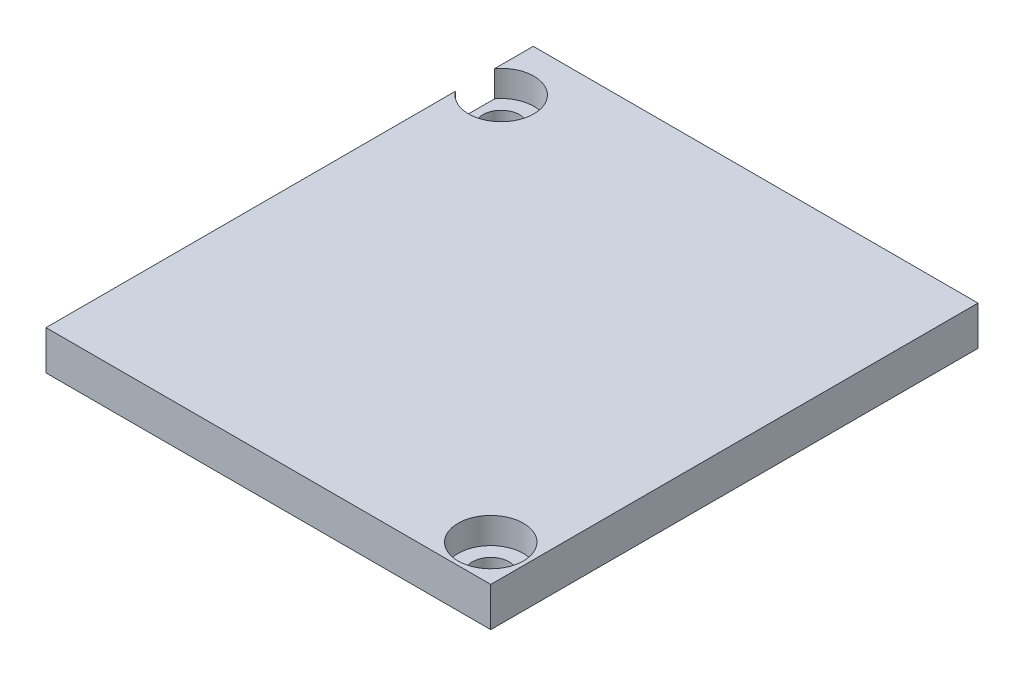
ISO-10303-21;
HEADER;
FILE_DESCRIPTION(('STEP AP214'),'2;1');
FILE_NAME('part.step','',(''),(''),'','','');
FILE_SCHEMA(('AUTOMOTIVE_DESIGN { 1 0 10303 214 1 1 1 1 }'));
ENDSEC;
DATA;
#1=APPLICATION_CONTEXT('core data for automotive mechanical design processes');
#2=APPLICATION_PROTOCOL_DEFINITION('international standard','automotive_design',2000,#1);
#3=PRODUCT_CONTEXT('',#1,'mechanical');
#4=PRODUCT('Part','Part','',(#3));
#5=PRODUCT_RELATED_PRODUCT_CATEGORY('part','',(#4));
#6=PRODUCT_DEFINITION_FORMATION('','',#4);
#7=PRODUCT_DEFINITION_CONTEXT('part definition',#1,'design');
#8=PRODUCT_DEFINITION('design','',#6,#7);
#9=PRODUCT_DEFINITION_SHAPE('','',#8);
#10=(LENGTH_UNIT() NAMED_UNIT(*) SI_UNIT(.MILLI.,.METRE.));
#11=(NAMED_UNIT(*) PLANE_ANGLE_UNIT() SI_UNIT($,.RADIAN.));
#12=(NAMED_UNIT(*) SI_UNIT($,.STERADIAN.) SOLID_ANGLE_UNIT());
#13=UNCERTAINTY_MEASURE_WITH_UNIT(LENGTH_MEASURE(1.E-05),#10,'distance_accuracy_value','');
#14=(GEOMETRIC_REPRESENTATION_CONTEXT(3) GLOBAL_UNCERTAINTY_ASSIGNED_CONTEXT((#13)) GLOBAL_UNIT_ASSIGNED_CONTEXT((#10,
#11,#12)) REPRESENTATION_CONTEXT('',''));
#15=CARTESIAN_POINT('',(0.,0.,0.));
#16=DIRECTION('',(0.,0.,1.));
#17=DIRECTION('',(1.,0.,0.));
#18=AXIS2_PLACEMENT_3D('',#15,#16,#17);
#19=CARTESIAN_POINT('',(17.,3.,18.625));
#20=DIRECTION('',(-1.,0.,0.));
#21=DIRECTION('',(0.,0.,1.));
#22=AXIS2_PLACEMENT_3D('',#19,#20,#21);
#23=PLANE('',#22);
#24=DIRECTION('',(0.,0.,-1.));
#25=VECTOR('',#24,1.);
#26=CARTESIAN_POINT('',(17.,0.,18.625));
#27=LINE('',#26,#25);
#28=CARTESIAN_POINT('',(17.,0.,18.625));
#29=VERTEX_POINT('',#28);
#30=CARTESIAN_POINT('',(17.,0.,-18.625));
#31=VERTEX_POINT('',#30);
#32=EDGE_CURVE('E116',#29,#31,#27,.T.);
#33=ORIENTED_EDGE('',*,*,#32,.T.);
#34=DIRECTION('',(0.,-1.,0.));
#35=VECTOR('',#34,1.);
#36=CARTESIAN_POINT('',(17.,3.,-18.625));
#37=LINE('',#36,#35);
#38=CARTESIAN_POINT('',(17.,3.,-18.625));
#39=VERTEX_POINT('',#38);
#40=EDGE_CURVE('E164',#39,#31,#37,.T.);
#41=ORIENTED_EDGE('',*,*,#40,.F.);
#42=DIRECTION('',(0.,0.,-1.));
#43=VECTOR('',#42,1.);
#44=CARTESIAN_POINT('',(17.,3.,18.625));
#45=LINE('',#44,#43);
#46=CARTESIAN_POINT('',(17.,3.,18.625));
#47=VERTEX_POINT('',#46);
#48=EDGE_CURVE('E133',#47,#39,#45,.T.);
#49=ORIENTED_EDGE('',*,*,#48,.F.);
#50=DIRECTION('',(0.,-1.,0.));
#51=VECTOR('',#50,1.);
#52=CARTESIAN_POINT('',(17.,3.,18.625));
#53=LINE('',#52,#51);
#54=EDGE_CURVE('E143',#47,#29,#53,.T.);
#55=ORIENTED_EDGE('',*,*,#54,.T.);
#56=EDGE_LOOP('',(#33,#41,#49,#55));
#57=FACE_BOUND('',#56,.T.);
#58=ADVANCED_FACE('F45',(#57),#23,.F.);
#59=CARTESIAN_POINT('',(-17.,3.,-18.625));
#60=DIRECTION('',(0.,0.,1.));
#61=DIRECTION('',(1.,0.,0.));
#62=AXIS2_PLACEMENT_3D('',#59,#60,#61);
#63=PLANE('',#62);
#64=DIRECTION('',(-1.,0.,0.));
#65=VECTOR('',#64,1.);
#66=CARTESIAN_POINT('',(-17.,0.,-18.625));
#67=LINE('',#66,#65);
#68=CARTESIAN_POINT('',(-17.,0.,-18.625));
#69=VERTEX_POINT('',#68);
#70=EDGE_CURVE('E147',#31,#69,#67,.T.);
#71=ORIENTED_EDGE('',*,*,#70,.T.);
#72=DIRECTION('',(0.,-1.,0.));
#73=VECTOR('',#72,1.);
#74=CARTESIAN_POINT('',(-17.,3.,-18.625));
#75=LINE('',#74,#73);
#76=CARTESIAN_POINT('',(-17.,3.,-18.625));
#77=VERTEX_POINT('',#76);
#78=EDGE_CURVE('E160',#77,#69,#75,.T.);
#79=ORIENTED_EDGE('',*,*,#78,.F.);
#80=DIRECTION('',(-1.,0.,0.));
#81=VECTOR('',#80,1.);
#82=CARTESIAN_POINT('',(-17.,3.,-18.625));
#83=LINE('',#82,#81);
#84=EDGE_CURVE('E99',#39,#77,#83,.T.);
#85=ORIENTED_EDGE('',*,*,#84,.F.);
#86=ORIENTED_EDGE('',*,*,#40,.T.);
#87=EDGE_LOOP('',(#71,#79,#85,#86));
#88=FACE_BOUND('',#87,.T.);
#89=ADVANCED_FACE('F186',(#88),#63,.F.);
#90=CARTESIAN_POINT('',(-17.,3.,18.625));
#91=DIRECTION('',(1.,0.,0.));
#92=DIRECTION('',(0.,0.,-1.));
#93=AXIS2_PLACEMENT_3D('',#90,#91,#92);
#94=PLANE('',#93);
#95=DIRECTION('',(0.,0.,1.));
#96=VECTOR('',#95,1.);
#97=CARTESIAN_POINT('',(-17.,1.,18.625));
#98=LINE('',#97,#96);
#99=CARTESIAN_POINT('',(-17.,1.,-15.675));
#100=VERTEX_POINT('',#99);
#101=CARTESIAN_POINT('',(-17.,1.,-12.675));
#102=VERTEX_POINT('',#101);
#103=EDGE_CURVE('E11',#100,#102,#98,.T.);
#104=ORIENTED_EDGE('',*,*,#103,.F.);
#105=DIRECTION('',(0.,1.,0.));
#106=VECTOR('',#105,1.);
#107=CARTESIAN_POINT('',(-17.,1.,-15.675));
#108=LINE('',#107,#106);
#109=CARTESIAN_POINT('',(-17.,3.,-15.675));
#110=VERTEX_POINT('',#109);
#111=EDGE_CURVE('E107',#100,#110,#108,.T.);
#112=ORIENTED_EDGE('',*,*,#111,.T.);
#113=DIRECTION('',(0.,0.,1.));
#114=VECTOR('',#113,1.);
#115=CARTESIAN_POINT('',(-17.,3.,18.625));
#116=LINE('',#115,#114);
#117=EDGE_CURVE('E138',#77,#110,#116,.T.);
#118=ORIENTED_EDGE('',*,*,#117,.F.);
#119=ORIENTED_EDGE('',*,*,#78,.T.);
#120=DIRECTION('',(0.,0.,1.));
#121=VECTOR('',#120,1.);
#122=CARTESIAN_POINT('',(-17.,0.,18.625));
#123=LINE('',#122,#121);
#124=CARTESIAN_POINT('',(-17.,0.,18.625));
#125=VERTEX_POINT('',#124);
#126=EDGE_CURVE('E150',#69,#125,#123,.T.);
#127=ORIENTED_EDGE('',*,*,#126,.T.);
#128=DIRECTION('',(0.,-1.,0.));
#129=VECTOR('',#128,1.);
#130=CARTESIAN_POINT('',(-17.,3.,18.625));
#131=LINE('',#130,#129);
#132=CARTESIAN_POINT('',(-17.,3.,18.625));
#133=VERTEX_POINT('',#132);
#134=EDGE_CURVE('E157',#133,#125,#131,.T.);
#135=ORIENTED_EDGE('',*,*,#134,.F.);
#136=CARTESIAN_POINT('',(-17.,3.,-12.675));
#137=VERTEX_POINT('',#136);
#138=EDGE_CURVE('E126',#137,#133,#116,.T.);
#139=ORIENTED_EDGE('',*,*,#138,.F.);
#140=DIRECTION('',(0.,1.,0.));
#141=VECTOR('',#140,1.);
#142=CARTESIAN_POINT('',(-17.,1.,-12.675));
#143=LINE('',#142,#141);
#144=EDGE_CURVE('E61',#137,#102,#143,.F.);
#145=ORIENTED_EDGE('',*,*,#144,.T.);
#146=EDGE_LOOP('',(#104,#112,#118,#119,#127,#135,#139,#145));
#147=FACE_BOUND('',#146,.T.);
#148=ADVANCED_FACE('F123',(#147),#94,.F.);
#149=CARTESIAN_POINT('',(-17.,3.,18.625));
#150=DIRECTION('',(0.,0.,-1.));
#151=DIRECTION('',(-1.,0.,0.));
#152=AXIS2_PLACEMENT_3D('',#149,#150,#151);
#153=PLANE('',#152);
#154=DIRECTION('',(1.,0.,0.));
#155=VECTOR('',#154,1.);
#156=CARTESIAN_POINT('',(-17.,0.,18.625));
#157=LINE('',#156,#155);
#158=EDGE_CURVE('E91',#125,#29,#157,.T.);
#159=ORIENTED_EDGE('',*,*,#158,.T.);
#160=ORIENTED_EDGE('',*,*,#54,.F.);
#161=DIRECTION('',(1.,0.,0.));
#162=VECTOR('',#161,1.);
#163=CARTESIAN_POINT('',(-17.,3.,18.625));
#164=LINE('',#163,#162);
#165=EDGE_CURVE('E70',#133,#47,#164,.T.);
#166=ORIENTED_EDGE('',*,*,#165,.F.);
#167=ORIENTED_EDGE('',*,*,#134,.T.);
#168=EDGE_LOOP('',(#159,#160,#166,#167));
#169=FACE_BOUND('',#168,.T.);
#170=ADVANCED_FACE('F176',(#169),#153,.F.);
#171=CARTESIAN_POINT('',(0.,3.,0.));
#172=DIRECTION('',(0.,-1.,0.));
#173=DIRECTION('',(0.,0.,-1.));
#174=AXIS2_PLACEMENT_3D('',#171,#172,#173);
#175=PLANE('',#174);
#176=CARTESIAN_POINT('',(14.2,3.,15.825));
#177=DIRECTION('',(0.,1.,0.));
#178=DIRECTION('',(0.,0.,1.));
#179=AXIS2_PLACEMENT_3D('',#176,#177,#178);
#180=CIRCLE('',#179,2.5);
#181=CARTESIAN_POINT('',(14.2,3.,18.325));
#182=VERTEX_POINT('',#181);
#183=EDGE_CURVE('E121',#182,#182,#180,.T.);
#184=ORIENTED_EDGE('',*,*,#183,.F.);
#185=EDGE_LOOP('',(#184));
#186=FACE_BOUND('',#185,.T.);
#187=ORIENTED_EDGE('',*,*,#117,.T.);
#188=CARTESIAN_POINT('',(-15.,3.,-14.175));
#189=DIRECTION('',(0.,-1.,0.));
#190=DIRECTION('',(0.,0.,-1.));
#191=AXIS2_PLACEMENT_3D('',#188,#189,#190);
#192=CIRCLE('',#191,2.5);
#193=EDGE_CURVE('E54',#110,#137,#192,.T.);
#194=ORIENTED_EDGE('',*,*,#193,.T.);
#195=ORIENTED_EDGE('',*,*,#138,.T.);
#196=ORIENTED_EDGE('',*,*,#165,.T.);
#197=ORIENTED_EDGE('',*,*,#48,.T.);
#198=ORIENTED_EDGE('',*,*,#84,.T.);
#199=EDGE_LOOP('',(#187,#194,#195,#196,#197,#198));
#200=FACE_BOUND('',#199,.T.);
#201=ADVANCED_FACE('F168',(#186,#200),#175,.F.);
#202=CARTESIAN_POINT('',(0.,0.,0.));
#203=DIRECTION('',(0.,-1.,0.));
#204=DIRECTION('',(0.,0.,-1.));
#205=AXIS2_PLACEMENT_3D('',#202,#203,#204);
#206=PLANE('',#205);
#207=CARTESIAN_POINT('',(-15.,0.,-14.175));
#208=DIRECTION('',(0.,-1.,0.));
#209=DIRECTION('',(0.,0.,-1.));
#210=AXIS2_PLACEMENT_3D('',#207,#208,#209);
#211=CIRCLE('',#210,1.4);
#212=CARTESIAN_POINT('',(-15.,0.,-15.575));
#213=VERTEX_POINT('',#212);
#214=EDGE_CURVE('E293',#213,#213,#211,.T.);
#215=ORIENTED_EDGE('',*,*,#214,.F.);
#216=EDGE_LOOP('',(#215));
#217=FACE_BOUND('',#216,.T.);
#218=CARTESIAN_POINT('',(14.2,0.,15.825));
#219=DIRECTION('',(0.,-1.,0.));
#220=DIRECTION('',(0.,0.,-1.));
#221=AXIS2_PLACEMENT_3D('',#218,#219,#220);
#222=CIRCLE('',#221,1.4);
#223=CARTESIAN_POINT('',(14.2,0.,14.425));
#224=VERTEX_POINT('',#223);
#225=EDGE_CURVE('E48',#224,#224,#222,.T.);
#226=ORIENTED_EDGE('',*,*,#225,.F.);
#227=EDGE_LOOP('',(#226));
#228=FACE_BOUND('',#227,.T.);
#229=ORIENTED_EDGE('',*,*,#32,.F.);
#230=ORIENTED_EDGE('',*,*,#158,.F.);
#231=ORIENTED_EDGE('',*,*,#126,.F.);
#232=ORIENTED_EDGE('',*,*,#70,.F.);
#233=EDGE_LOOP('',(#229,#230,#231,#232));
#234=FACE_BOUND('',#233,.T.);
#235=ADVANCED_FACE('F172',(#217,#228,#234),#206,.T.);
#236=CARTESIAN_POINT('',(14.2,1.,15.825));
#237=DIRECTION('',(0.,1.,0.));
#238=DIRECTION('',(0.,0.,1.));
#239=AXIS2_PLACEMENT_3D('',#236,#237,#238);
#240=CYLINDRICAL_SURFACE('',#239,2.5);
#241=CARTESIAN_POINT('',(14.2,1.,15.825));
#242=DIRECTION('',(0.,1.,0.));
#243=DIRECTION('',(0.,0.,1.));
#244=AXIS2_PLACEMENT_3D('',#241,#242,#243);
#245=CIRCLE('',#244,2.5);
#246=CARTESIAN_POINT('',(14.2,1.,18.325));
#247=VERTEX_POINT('',#246);
#248=EDGE_CURVE('E130',#247,#247,#245,.T.);
#249=ORIENTED_EDGE('',*,*,#248,.F.);
#250=EDGE_LOOP('',(#249));
#251=FACE_BOUND('',#250,.T.);
#252=ORIENTED_EDGE('',*,*,#183,.T.);
#253=EDGE_LOOP('',(#252));
#254=FACE_BOUND('',#253,.T.);
#255=ADVANCED_FACE('F224',(#251,#254),#240,.F.);
#256=CARTESIAN_POINT('',(14.2,1.,15.825));
#257=DIRECTION('',(0.,1.,0.));
#258=DIRECTION('',(0.,0.,1.));
#259=AXIS2_PLACEMENT_3D('',#256,#257,#258);
#260=PLANE('',#259);
#261=CARTESIAN_POINT('',(14.2,1.,15.825));
#262=DIRECTION('',(0.,1.,0.));
#263=DIRECTION('',(0.,0.,1.));
#264=AXIS2_PLACEMENT_3D('',#261,#262,#263);
#265=CIRCLE('',#264,1.4);
#266=CARTESIAN_POINT('',(14.2,1.,17.225));
#267=VERTEX_POINT('',#266);
#268=EDGE_CURVE('E287',#267,#267,#265,.T.);
#269=ORIENTED_EDGE('',*,*,#268,.F.);
#270=EDGE_LOOP('',(#269));
#271=FACE_BOUND('',#270,.T.);
#272=ORIENTED_EDGE('',*,*,#248,.T.);
#273=EDGE_LOOP('',(#272));
#274=FACE_BOUND('',#273,.T.);
#275=ADVANCED_FACE('F234',(#271,#274),#260,.T.);
#276=CARTESIAN_POINT('',(-15.,1.,-14.175));
#277=DIRECTION('',(0.,1.,0.));
#278=DIRECTION('',(0.,0.,1.));
#279=AXIS2_PLACEMENT_3D('',#276,#277,#278);
#280=PLANE('',#279);
#281=CARTESIAN_POINT('',(-15.,1.,-14.175));
#282=DIRECTION('',(0.,1.,0.));
#283=DIRECTION('',(0.,0.,1.));
#284=AXIS2_PLACEMENT_3D('',#281,#282,#283);
#285=CIRCLE('',#284,1.4);
#286=CARTESIAN_POINT('',(-15.,1.,-12.775));
#287=VERTEX_POINT('',#286);
#288=EDGE_CURVE('E289',#287,#287,#285,.T.);
#289=ORIENTED_EDGE('',*,*,#288,.F.);
#290=EDGE_LOOP('',(#289));
#291=FACE_BOUND('',#290,.T.);
#292=ORIENTED_EDGE('',*,*,#103,.T.);
#293=CARTESIAN_POINT('',(-15.,1.,-14.175));
#294=DIRECTION('',(0.,1.,0.));
#295=DIRECTION('',(0.,0.,1.));
#296=AXIS2_PLACEMENT_3D('',#293,#294,#295);
#297=CIRCLE('',#296,2.5);
#298=EDGE_CURVE('E110',#102,#100,#297,.T.);
#299=ORIENTED_EDGE('',*,*,#298,.T.);
#300=EDGE_LOOP('',(#292,#299));
#301=FACE_BOUND('',#300,.T.);
#302=ADVANCED_FACE('F119',(#291,#301),#280,.T.);
#303=CARTESIAN_POINT('',(-15.,1.,-14.175));
#304=DIRECTION('',(0.,1.,0.));
#305=DIRECTION('',(0.,0.,1.));
#306=AXIS2_PLACEMENT_3D('',#303,#304,#305);
#307=CYLINDRICAL_SURFACE('',#306,2.5);
#308=ORIENTED_EDGE('',*,*,#298,.F.);
#309=ORIENTED_EDGE('',*,*,#144,.F.);
#310=ORIENTED_EDGE('',*,*,#193,.F.);
#311=ORIENTED_EDGE('',*,*,#111,.F.);
#312=EDGE_LOOP('',(#308,#309,#310,#311));
#313=FACE_BOUND('',#312,.T.);
#314=ADVANCED_FACE('F109',(#313),#307,.F.);
#315=CARTESIAN_POINT('',(-15.,-1.,-14.175));
#316=DIRECTION('',(0.,1.,0.));
#317=DIRECTION('',(0.,0.,1.));
#318=AXIS2_PLACEMENT_3D('',#315,#316,#317);
#319=CYLINDRICAL_SURFACE('',#318,1.4);
#320=ORIENTED_EDGE('',*,*,#214,.T.);
#321=EDGE_LOOP('',(#320));
#322=FACE_BOUND('',#321,.T.);
#323=ORIENTED_EDGE('',*,*,#288,.T.);
#324=EDGE_LOOP('',(#323));
#325=FACE_BOUND('',#324,.T.);
#326=ADVANCED_FACE('F261',(#322,#325),#319,.F.);
#327=CARTESIAN_POINT('',(14.2,-1.,15.825));
#328=DIRECTION('',(0.,1.,0.));
#329=DIRECTION('',(0.,0.,1.));
#330=AXIS2_PLACEMENT_3D('',#327,#328,#329);
#331=CYLINDRICAL_SURFACE('',#330,1.4);
#332=ORIENTED_EDGE('',*,*,#225,.T.);
#333=EDGE_LOOP('',(#332));
#334=FACE_BOUND('',#333,.T.);
#335=ORIENTED_EDGE('',*,*,#268,.T.);
#336=EDGE_LOOP('',(#335));
#337=FACE_BOUND('',#336,.T.);
#338=ADVANCED_FACE('F269',(#334,#337),#331,.F.);
#339=CLOSED_SHELL('',(#58,#89,#148,#170,#201,#235,#255,#275,#302,#314,#326,#338));
#340=MANIFOLD_SOLID_BREP('B2',#339);
#341=ADVANCED_BREP_SHAPE_REPRESENTATION('',(#18,#340),#14);
#342=SHAPE_DEFINITION_REPRESENTATION(#9,#341);
ENDSEC;
END-ISO-10303-21;
